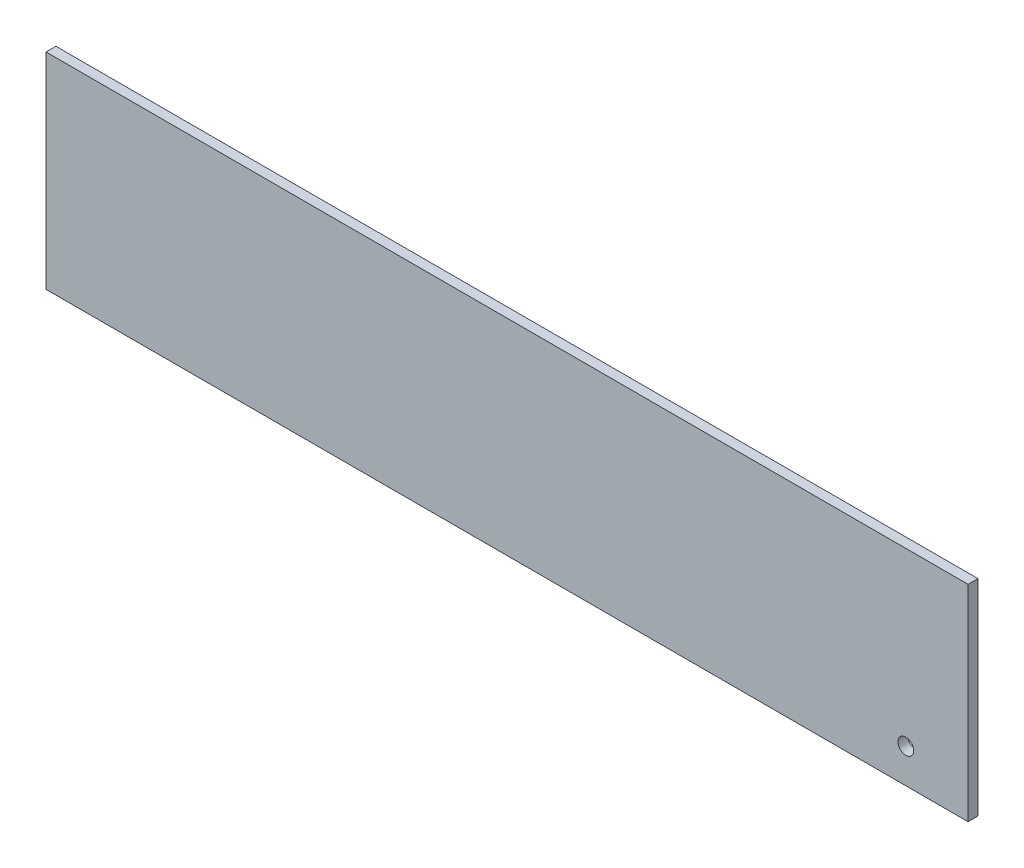
ISO-10303-21;
HEADER;
FILE_DESCRIPTION(('STEP AP214'),'2;1');
FILE_NAME('part.step','',(''),(''),'','','');
FILE_SCHEMA(('AUTOMOTIVE_DESIGN { 1 0 10303 214 1 1 1 1 }'));
ENDSEC;
DATA;
#1=APPLICATION_CONTEXT('core data for automotive mechanical design processes');
#2=APPLICATION_PROTOCOL_DEFINITION('international standard','automotive_design',2000,#1);
#3=PRODUCT_CONTEXT('',#1,'mechanical');
#4=PRODUCT('Part','Part','',(#3));
#5=PRODUCT_RELATED_PRODUCT_CATEGORY('part','',(#4));
#6=PRODUCT_DEFINITION_FORMATION('','',#4);
#7=PRODUCT_DEFINITION_CONTEXT('part definition',#1,'design');
#8=PRODUCT_DEFINITION('design','',#6,#7);
#9=PRODUCT_DEFINITION_SHAPE('','',#8);
#10=(LENGTH_UNIT() NAMED_UNIT(*) SI_UNIT(.MILLI.,.METRE.));
#11=(NAMED_UNIT(*) PLANE_ANGLE_UNIT() SI_UNIT($,.RADIAN.));
#12=(NAMED_UNIT(*) SI_UNIT($,.STERADIAN.) SOLID_ANGLE_UNIT());
#13=UNCERTAINTY_MEASURE_WITH_UNIT(LENGTH_MEASURE(1.E-05),#10,'distance_accuracy_value','');
#14=(GEOMETRIC_REPRESENTATION_CONTEXT(3) GLOBAL_UNCERTAINTY_ASSIGNED_CONTEXT((#13)) GLOBAL_UNIT_ASSIGNED_CONTEXT((#10,
#11,#12)) REPRESENTATION_CONTEXT('',''));
#15=CARTESIAN_POINT('',(0.,0.,0.));
#16=DIRECTION('',(0.,0.,1.));
#17=DIRECTION('',(1.,0.,0.));
#18=AXIS2_PLACEMENT_3D('',#15,#16,#17);
#19=CARTESIAN_POINT('',(0.,0.,6.35));
#20=DIRECTION('',(0.,0.,-1.));
#21=DIRECTION('',(-1.,0.,0.));
#22=AXIS2_PLACEMENT_3D('',#19,#20,#21);
#23=PLANE('',#22);
#24=DIRECTION('',(0.,-1.,0.));
#25=VECTOR('',#24,1.);
#26=CARTESIAN_POINT('',(0.,0.,6.35));
#27=LINE('',#26,#25);
#28=CARTESIAN_POINT('',(0.,132.,6.35));
#29=VERTEX_POINT('',#28);
#30=CARTESIAN_POINT('',(0.,0.,6.35));
#31=VERTEX_POINT('',#30);
#32=EDGE_CURVE('E85',#29,#31,#27,.T.);
#33=ORIENTED_EDGE('',*,*,#32,.T.);
#34=DIRECTION('',(1.,0.,0.));
#35=VECTOR('',#34,1.);
#36=CARTESIAN_POINT('',(0.,0.,6.35));
#37=LINE('',#36,#35);
#38=CARTESIAN_POINT('',(592.,0.,6.35));
#39=VERTEX_POINT('',#38);
#40=EDGE_CURVE('E80',#31,#39,#37,.T.);
#41=ORIENTED_EDGE('',*,*,#40,.T.);
#42=DIRECTION('',(0.,1.,0.));
#43=VECTOR('',#42,1.);
#44=CARTESIAN_POINT('',(592.,0.,6.35));
#45=LINE('',#44,#43);
#46=CARTESIAN_POINT('',(592.,132.,6.35));
#47=VERTEX_POINT('',#46);
#48=EDGE_CURVE('E83',#39,#47,#45,.T.);
#49=ORIENTED_EDGE('',*,*,#48,.T.);
#50=DIRECTION('',(-1.,0.,0.));
#51=VECTOR('',#50,1.);
#52=CARTESIAN_POINT('',(0.,132.,6.35));
#53=LINE('',#52,#51);
#54=EDGE_CURVE('E50',#47,#29,#53,.T.);
#55=ORIENTED_EDGE('',*,*,#54,.T.);
#56=EDGE_LOOP('',(#33,#41,#49,#55));
#57=FACE_BOUND('',#56,.T.);
#58=CARTESIAN_POINT('',(552.,22.,6.35));
#59=DIRECTION('',(0.,0.,1.));
#60=DIRECTION('',(1.,0.,0.));
#61=AXIS2_PLACEMENT_3D('',#58,#59,#60);
#62=CIRCLE('',#61,5.04999999999996);
#63=CARTESIAN_POINT('',(557.05,22.,6.35));
#64=VERTEX_POINT('',#63);
#65=EDGE_CURVE('E100',#64,#64,#62,.T.);
#66=ORIENTED_EDGE('',*,*,#65,.F.);
#67=EDGE_LOOP('',(#66));
#68=FACE_BOUND('',#67,.T.);
#69=ADVANCED_FACE('F33',(#57,#68),#23,.F.);
#70=CARTESIAN_POINT('',(0.,0.,0.));
#71=DIRECTION('',(0.,0.,-1.));
#72=DIRECTION('',(-1.,0.,0.));
#73=AXIS2_PLACEMENT_3D('',#70,#71,#72);
#74=PLANE('',#73);
#75=DIRECTION('',(0.,-1.,0.));
#76=VECTOR('',#75,1.);
#77=CARTESIAN_POINT('',(0.,0.,0.));
#78=LINE('',#77,#76);
#79=CARTESIAN_POINT('',(0.,132.,0.));
#80=VERTEX_POINT('',#79);
#81=CARTESIAN_POINT('',(0.,0.,0.));
#82=VERTEX_POINT('',#81);
#83=EDGE_CURVE('E97',#80,#82,#78,.T.);
#84=ORIENTED_EDGE('',*,*,#83,.F.);
#85=DIRECTION('',(-1.,0.,0.));
#86=VECTOR('',#85,1.);
#87=CARTESIAN_POINT('',(0.,132.,0.));
#88=LINE('',#87,#86);
#89=CARTESIAN_POINT('',(592.,132.,0.));
#90=VERTEX_POINT('',#89);
#91=EDGE_CURVE('E73',#90,#80,#88,.T.);
#92=ORIENTED_EDGE('',*,*,#91,.F.);
#93=DIRECTION('',(0.,1.,0.));
#94=VECTOR('',#93,1.);
#95=CARTESIAN_POINT('',(592.,0.,0.));
#96=LINE('',#95,#94);
#97=CARTESIAN_POINT('',(592.,0.,0.));
#98=VERTEX_POINT('',#97);
#99=EDGE_CURVE('E67',#98,#90,#96,.T.);
#100=ORIENTED_EDGE('',*,*,#99,.F.);
#101=DIRECTION('',(1.,0.,0.));
#102=VECTOR('',#101,1.);
#103=CARTESIAN_POINT('',(0.,0.,0.));
#104=LINE('',#103,#102);
#105=EDGE_CURVE('E89',#82,#98,#104,.T.);
#106=ORIENTED_EDGE('',*,*,#105,.F.);
#107=EDGE_LOOP('',(#84,#92,#100,#106));
#108=FACE_BOUND('',#107,.T.);
#109=CARTESIAN_POINT('',(552.,22.,0.));
#110=DIRECTION('',(0.,0.,1.));
#111=DIRECTION('',(1.,0.,0.));
#112=AXIS2_PLACEMENT_3D('',#109,#110,#111);
#113=CIRCLE('',#112,5.04999999999996);
#114=CARTESIAN_POINT('',(557.05,22.,0.));
#115=VERTEX_POINT('',#114);
#116=EDGE_CURVE('E112',#115,#115,#113,.T.);
#117=ORIENTED_EDGE('',*,*,#116,.T.);
#118=EDGE_LOOP('',(#117));
#119=FACE_BOUND('',#118,.T.);
#120=ADVANCED_FACE('F108',(#108,#119),#74,.T.);
#121=CARTESIAN_POINT('',(0.,0.,6.35));
#122=DIRECTION('',(1.,0.,0.));
#123=DIRECTION('',(0.,0.,-1.));
#124=AXIS2_PLACEMENT_3D('',#121,#122,#123);
#125=PLANE('',#124);
#126=ORIENTED_EDGE('',*,*,#83,.T.);
#127=DIRECTION('',(0.,0.,-1.));
#128=VECTOR('',#127,1.);
#129=CARTESIAN_POINT('',(0.,0.,6.35));
#130=LINE('',#129,#128);
#131=EDGE_CURVE('E11',#31,#82,#130,.T.);
#132=ORIENTED_EDGE('',*,*,#131,.F.);
#133=ORIENTED_EDGE('',*,*,#32,.F.);
#134=DIRECTION('',(0.,0.,-1.));
#135=VECTOR('',#134,1.);
#136=CARTESIAN_POINT('',(0.,132.,6.35));
#137=LINE('',#136,#135);
#138=EDGE_CURVE('E93',#29,#80,#137,.T.);
#139=ORIENTED_EDGE('',*,*,#138,.T.);
#140=EDGE_LOOP('',(#126,#132,#133,#139));
#141=FACE_BOUND('',#140,.T.);
#142=ADVANCED_FACE('F35',(#141),#125,.F.);
#143=CARTESIAN_POINT('',(0.,0.,6.35));
#144=DIRECTION('',(0.,1.,0.));
#145=DIRECTION('',(0.,0.,1.));
#146=AXIS2_PLACEMENT_3D('',#143,#144,#145);
#147=PLANE('',#146);
#148=ORIENTED_EDGE('',*,*,#105,.T.);
#149=DIRECTION('',(0.,0.,-1.));
#150=VECTOR('',#149,1.);
#151=CARTESIAN_POINT('',(592.,0.,6.35));
#152=LINE('',#151,#150);
#153=EDGE_CURVE('E42',#39,#98,#152,.T.);
#154=ORIENTED_EDGE('',*,*,#153,.F.);
#155=ORIENTED_EDGE('',*,*,#40,.F.);
#156=ORIENTED_EDGE('',*,*,#131,.T.);
#157=EDGE_LOOP('',(#148,#154,#155,#156));
#158=FACE_BOUND('',#157,.T.);
#159=ADVANCED_FACE('F88',(#158),#147,.F.);
#160=CARTESIAN_POINT('',(592.,0.,6.35));
#161=DIRECTION('',(-1.,0.,0.));
#162=DIRECTION('',(0.,0.,1.));
#163=AXIS2_PLACEMENT_3D('',#160,#161,#162);
#164=PLANE('',#163);
#165=ORIENTED_EDGE('',*,*,#99,.T.);
#166=DIRECTION('',(0.,0.,-1.));
#167=VECTOR('',#166,1.);
#168=CARTESIAN_POINT('',(592.,132.,6.35));
#169=LINE('',#168,#167);
#170=EDGE_CURVE('E90',#47,#90,#169,.T.);
#171=ORIENTED_EDGE('',*,*,#170,.F.);
#172=ORIENTED_EDGE('',*,*,#48,.F.);
#173=ORIENTED_EDGE('',*,*,#153,.T.);
#174=EDGE_LOOP('',(#165,#171,#172,#173));
#175=FACE_BOUND('',#174,.T.);
#176=ADVANCED_FACE('F91',(#175),#164,.F.);
#177=CARTESIAN_POINT('',(0.,132.,6.35));
#178=DIRECTION('',(0.,-1.,0.));
#179=DIRECTION('',(0.,0.,-1.));
#180=AXIS2_PLACEMENT_3D('',#177,#178,#179);
#181=PLANE('',#180);
#182=ORIENTED_EDGE('',*,*,#91,.T.);
#183=ORIENTED_EDGE('',*,*,#138,.F.);
#184=ORIENTED_EDGE('',*,*,#54,.F.);
#185=ORIENTED_EDGE('',*,*,#170,.T.);
#186=EDGE_LOOP('',(#182,#183,#184,#185));
#187=FACE_BOUND('',#186,.T.);
#188=ADVANCED_FACE('F105',(#187),#181,.F.);
#189=CARTESIAN_POINT('',(552.,22.,6.35));
#190=DIRECTION('',(0.,0.,-1.));
#191=DIRECTION('',(-1.,0.,0.));
#192=AXIS2_PLACEMENT_3D('',#189,#190,#191);
#193=CYLINDRICAL_SURFACE('',#192,5.04999999999996);
#194=ORIENTED_EDGE('',*,*,#65,.T.);
#195=EDGE_LOOP('',(#194));
#196=FACE_BOUND('',#195,.T.);
#197=ORIENTED_EDGE('',*,*,#116,.F.);
#198=EDGE_LOOP('',(#197));
#199=FACE_BOUND('',#198,.T.);
#200=ADVANCED_FACE('F118',(#196,#199),#193,.F.);
#201=CLOSED_SHELL('',(#69,#120,#142,#159,#176,#188,#200));
#202=MANIFOLD_SOLID_BREP('B2',#201);
#203=ADVANCED_BREP_SHAPE_REPRESENTATION('',(#18,#202),#14);
#204=SHAPE_DEFINITION_REPRESENTATION(#9,#203);
ENDSEC;
END-ISO-10303-21;
